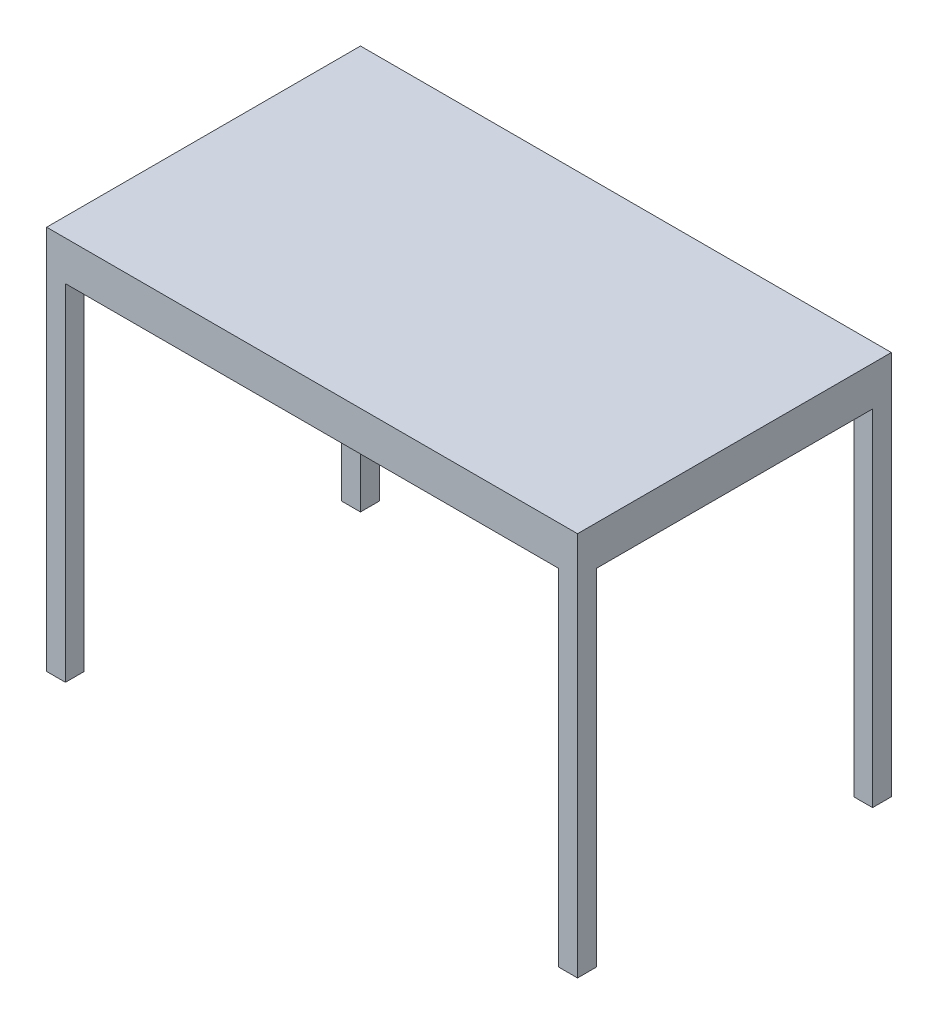
ISO-10303-21;
HEADER;
FILE_DESCRIPTION(('STEP AP214'),'2;1');
FILE_NAME('part.step','',(''),(''),'','','');
FILE_SCHEMA(('AUTOMOTIVE_DESIGN { 1 0 10303 214 1 1 1 1 }'));
ENDSEC;
DATA;
#1=APPLICATION_CONTEXT('core data for automotive mechanical design processes');
#2=APPLICATION_PROTOCOL_DEFINITION('international standard','automotive_design',2000,#1);
#3=PRODUCT_CONTEXT('',#1,'mechanical');
#4=PRODUCT('Part','Part','',(#3));
#5=PRODUCT_RELATED_PRODUCT_CATEGORY('part','',(#4));
#6=PRODUCT_DEFINITION_FORMATION('','',#4);
#7=PRODUCT_DEFINITION_CONTEXT('part definition',#1,'design');
#8=PRODUCT_DEFINITION('design','',#6,#7);
#9=PRODUCT_DEFINITION_SHAPE('','',#8);
#10=(LENGTH_UNIT() NAMED_UNIT(*) SI_UNIT(.MILLI.,.METRE.));
#11=(NAMED_UNIT(*) PLANE_ANGLE_UNIT() SI_UNIT($,.RADIAN.));
#12=(NAMED_UNIT(*) SI_UNIT($,.STERADIAN.) SOLID_ANGLE_UNIT());
#13=UNCERTAINTY_MEASURE_WITH_UNIT(LENGTH_MEASURE(1.E-05),#10,'distance_accuracy_value','');
#14=(GEOMETRIC_REPRESENTATION_CONTEXT(3) GLOBAL_UNCERTAINTY_ASSIGNED_CONTEXT((#13)) GLOBAL_UNIT_ASSIGNED_CONTEXT((#10,
#11,#12)) REPRESENTATION_CONTEXT('',''));
#15=CARTESIAN_POINT('',(0.,0.,0.));
#16=DIRECTION('',(0.,0.,1.));
#17=DIRECTION('',(1.,0.,0.));
#18=AXIS2_PLACEMENT_3D('',#15,#16,#17);
#19=CARTESIAN_POINT('',(0.,700.,0.));
#20=DIRECTION('',(0.,1.,0.));
#21=DIRECTION('',(0.,0.,1.));
#22=AXIS2_PLACEMENT_3D('',#19,#20,#21);
#23=PLANE('',#22);
#24=DIRECTION('',(-1.,0.,0.));
#25=VECTOR('',#24,1.);
#26=CARTESIAN_POINT('',(1038.1,700.,598.1));
#27=LINE('',#26,#25);
#28=CARTESIAN_POINT('',(1076.2,700.,598.1));
#29=VERTEX_POINT('',#28);
#30=CARTESIAN_POINT('',(1038.1,700.,598.1));
#31=VERTEX_POINT('',#30);
#32=EDGE_CURVE('E48',#29,#31,#27,.T.);
#33=ORIENTED_EDGE('',*,*,#32,.T.);
#34=DIRECTION('',(0.,0.,1.));
#35=VECTOR('',#34,1.);
#36=CARTESIAN_POINT('',(1038.1,700.,636.2));
#37=LINE('',#36,#35);
#38=CARTESIAN_POINT('',(1038.1,700.,636.2));
#39=VERTEX_POINT('',#38);
#40=EDGE_CURVE('E158',#31,#39,#37,.T.);
#41=ORIENTED_EDGE('',*,*,#40,.T.);
#42=DIRECTION('',(1.,0.,0.));
#43=VECTOR('',#42,1.);
#44=CARTESIAN_POINT('',(0.,700.,636.2));
#45=LINE('',#44,#43);
#46=CARTESIAN_POINT('',(38.1,700.,636.2));
#47=VERTEX_POINT('',#46);
#48=EDGE_CURVE('E239',#47,#39,#45,.T.);
#49=ORIENTED_EDGE('',*,*,#48,.F.);
#50=DIRECTION('',(0.,0.,-1.));
#51=VECTOR('',#50,1.);
#52=CARTESIAN_POINT('',(38.1,700.,636.2));
#53=LINE('',#52,#51);
#54=CARTESIAN_POINT('',(38.1,700.,598.1));
#55=VERTEX_POINT('',#54);
#56=EDGE_CURVE('E180',#47,#55,#53,.T.);
#57=ORIENTED_EDGE('',*,*,#56,.T.);
#58=DIRECTION('',(-1.,0.,0.));
#59=VECTOR('',#58,1.);
#60=CARTESIAN_POINT('',(0.,700.,598.1));
#61=LINE('',#60,#59);
#62=CARTESIAN_POINT('',(0.,700.,598.1));
#63=VERTEX_POINT('',#62);
#64=EDGE_CURVE('E183',#55,#63,#61,.T.);
#65=ORIENTED_EDGE('',*,*,#64,.T.);
#66=DIRECTION('',(0.,0.,1.));
#67=VECTOR('',#66,1.);
#68=CARTESIAN_POINT('',(0.,700.,0.));
#69=LINE('',#68,#67);
#70=CARTESIAN_POINT('',(0.,700.,38.1));
#71=VERTEX_POINT('',#70);
#72=EDGE_CURVE('E224',#71,#63,#69,.T.);
#73=ORIENTED_EDGE('',*,*,#72,.F.);
#74=DIRECTION('',(1.,0.,0.));
#75=VECTOR('',#74,1.);
#76=CARTESIAN_POINT('',(0.,700.,38.1));
#77=LINE('',#76,#75);
#78=CARTESIAN_POINT('',(38.1,700.,38.1));
#79=VERTEX_POINT('',#78);
#80=EDGE_CURVE('E249',#71,#79,#77,.T.);
#81=ORIENTED_EDGE('',*,*,#80,.T.);
#82=DIRECTION('',(0.,0.,-1.));
#83=VECTOR('',#82,1.);
#84=CARTESIAN_POINT('',(38.1,700.,0.));
#85=LINE('',#84,#83);
#86=CARTESIAN_POINT('',(38.1,700.,0.));
#87=VERTEX_POINT('',#86);
#88=EDGE_CURVE('E252',#79,#87,#85,.T.);
#89=ORIENTED_EDGE('',*,*,#88,.T.);
#90=DIRECTION('',(-1.,0.,0.));
#91=VECTOR('',#90,1.);
#92=CARTESIAN_POINT('',(0.,700.,0.));
#93=LINE('',#92,#91);
#94=CARTESIAN_POINT('',(1038.1,700.,0.));
#95=VERTEX_POINT('',#94);
#96=EDGE_CURVE('E229',#95,#87,#93,.T.);
#97=ORIENTED_EDGE('',*,*,#96,.F.);
#98=DIRECTION('',(0.,0.,1.));
#99=VECTOR('',#98,1.);
#100=CARTESIAN_POINT('',(1038.1,700.,0.));
#101=LINE('',#100,#99);
#102=CARTESIAN_POINT('',(1038.1,700.,38.1));
#103=VERTEX_POINT('',#102);
#104=EDGE_CURVE('E202',#95,#103,#101,.T.);
#105=ORIENTED_EDGE('',*,*,#104,.T.);
#106=DIRECTION('',(1.,0.,0.));
#107=VECTOR('',#106,1.);
#108=CARTESIAN_POINT('',(1038.1,700.,38.1));
#109=LINE('',#108,#107);
#110=CARTESIAN_POINT('',(1076.2,700.,38.1));
#111=VERTEX_POINT('',#110);
#112=EDGE_CURVE('E205',#103,#111,#109,.T.);
#113=ORIENTED_EDGE('',*,*,#112,.T.);
#114=DIRECTION('',(0.,0.,-1.));
#115=VECTOR('',#114,1.);
#116=CARTESIAN_POINT('',(1076.2,700.,0.));
#117=LINE('',#116,#115);
#118=EDGE_CURVE('E166',#29,#111,#117,.T.);
#119=ORIENTED_EDGE('',*,*,#118,.F.);
#120=EDGE_LOOP('',(#33,#41,#49,#57,#65,#73,#81,#89,#97,#105,#113,#119));
#121=FACE_BOUND('',#120,.T.);
#122=ADVANCED_FACE('F33',(#121),#23,.F.);
#123=CARTESIAN_POINT('',(0.,700.,0.));
#124=DIRECTION('',(1.,0.,0.));
#125=DIRECTION('',(0.,0.,-1.));
#126=AXIS2_PLACEMENT_3D('',#123,#124,#125);
#127=PLANE('',#126);
#128=DIRECTION('',(0.,0.,1.));
#129=VECTOR('',#128,1.);
#130=CARTESIAN_POINT('',(0.,0.,0.));
#131=LINE('',#130,#129);
#132=CARTESIAN_POINT('',(0.,0.,0.));
#133=VERTEX_POINT('',#132);
#134=CARTESIAN_POINT('',(0.,0.,38.1));
#135=VERTEX_POINT('',#134);
#136=EDGE_CURVE('E248',#133,#135,#131,.T.);
#137=ORIENTED_EDGE('',*,*,#136,.T.);
#138=DIRECTION('',(0.,-1.,0.));
#139=VECTOR('',#138,1.);
#140=CARTESIAN_POINT('',(0.,700.,38.1));
#141=LINE('',#140,#139);
#142=EDGE_CURVE('E11',#71,#135,#141,.T.);
#143=ORIENTED_EDGE('',*,*,#142,.F.);
#144=ORIENTED_EDGE('',*,*,#72,.T.);
#145=DIRECTION('',(0.,-1.,0.));
#146=VECTOR('',#145,1.);
#147=CARTESIAN_POINT('',(0.,700.,598.1));
#148=LINE('',#147,#146);
#149=CARTESIAN_POINT('',(0.,0.,598.1));
#150=VERTEX_POINT('',#149);
#151=EDGE_CURVE('E187',#63,#150,#148,.T.);
#152=ORIENTED_EDGE('',*,*,#151,.T.);
#153=DIRECTION('',(0.,0.,1.));
#154=VECTOR('',#153,1.);
#155=CARTESIAN_POINT('',(0.,0.,636.2));
#156=LINE('',#155,#154);
#157=CARTESIAN_POINT('',(0.,0.,636.2));
#158=VERTEX_POINT('',#157);
#159=EDGE_CURVE('E184',#150,#158,#156,.T.);
#160=ORIENTED_EDGE('',*,*,#159,.T.);
#161=DIRECTION('',(0.,-1.,0.));
#162=VECTOR('',#161,1.);
#163=CARTESIAN_POINT('',(0.,780.,636.2));
#164=LINE('',#163,#162);
#165=CARTESIAN_POINT('',(0.,780.,636.2));
#166=VERTEX_POINT('',#165);
#167=EDGE_CURVE('E246',#166,#158,#164,.T.);
#168=ORIENTED_EDGE('',*,*,#167,.F.);
#169=DIRECTION('',(0.,0.,1.));
#170=VECTOR('',#169,1.);
#171=CARTESIAN_POINT('',(0.,780.,0.));
#172=LINE('',#171,#170);
#173=CARTESIAN_POINT('',(0.,780.,0.));
#174=VERTEX_POINT('',#173);
#175=EDGE_CURVE('E225',#174,#166,#172,.T.);
#176=ORIENTED_EDGE('',*,*,#175,.F.);
#177=DIRECTION('',(0.,-1.,0.));
#178=VECTOR('',#177,1.);
#179=CARTESIAN_POINT('',(0.,700.,0.));
#180=LINE('',#179,#178);
#181=EDGE_CURVE('E256',#174,#133,#180,.T.);
#182=ORIENTED_EDGE('',*,*,#181,.T.);
#183=EDGE_LOOP('',(#137,#143,#144,#152,#160,#168,#176,#182));
#184=FACE_BOUND('',#183,.T.);
#185=ADVANCED_FACE('F35',(#184),#127,.F.);
#186=CARTESIAN_POINT('',(0.,700.,38.1));
#187=DIRECTION('',(0.,0.,-1.));
#188=DIRECTION('',(-1.,0.,0.));
#189=AXIS2_PLACEMENT_3D('',#186,#187,#188);
#190=PLANE('',#189);
#191=DIRECTION('',(1.,0.,0.));
#192=VECTOR('',#191,1.);
#193=CARTESIAN_POINT('',(0.,0.,38.1));
#194=LINE('',#193,#192);
#195=CARTESIAN_POINT('',(38.1,0.,38.1));
#196=VERTEX_POINT('',#195);
#197=EDGE_CURVE('E259',#135,#196,#194,.T.);
#198=ORIENTED_EDGE('',*,*,#197,.T.);
#199=DIRECTION('',(0.,-1.,0.));
#200=VECTOR('',#199,1.);
#201=CARTESIAN_POINT('',(38.1,700.,38.1));
#202=LINE('',#201,#200);
#203=EDGE_CURVE('E41',#79,#196,#202,.T.);
#204=ORIENTED_EDGE('',*,*,#203,.F.);
#205=ORIENTED_EDGE('',*,*,#80,.F.);
#206=ORIENTED_EDGE('',*,*,#142,.T.);
#207=EDGE_LOOP('',(#198,#204,#205,#206));
#208=FACE_BOUND('',#207,.T.);
#209=ADVANCED_FACE('F308',(#208),#190,.F.);
#210=CARTESIAN_POINT('',(38.1,700.,0.));
#211=DIRECTION('',(-1.,0.,0.));
#212=DIRECTION('',(0.,0.,1.));
#213=AXIS2_PLACEMENT_3D('',#210,#211,#212);
#214=PLANE('',#213);
#215=DIRECTION('',(0.,0.,-1.));
#216=VECTOR('',#215,1.);
#217=CARTESIAN_POINT('',(38.1,0.,0.));
#218=LINE('',#217,#216);
#219=CARTESIAN_POINT('',(38.1,0.,0.));
#220=VERTEX_POINT('',#219);
#221=EDGE_CURVE('E261',#196,#220,#218,.T.);
#222=ORIENTED_EDGE('',*,*,#221,.T.);
#223=DIRECTION('',(0.,-1.,0.));
#224=VECTOR('',#223,1.);
#225=CARTESIAN_POINT('',(38.1,700.,0.));
#226=LINE('',#225,#224);
#227=EDGE_CURVE('E266',#87,#220,#226,.T.);
#228=ORIENTED_EDGE('',*,*,#227,.F.);
#229=ORIENTED_EDGE('',*,*,#88,.F.);
#230=ORIENTED_EDGE('',*,*,#203,.T.);
#231=EDGE_LOOP('',(#222,#228,#229,#230));
#232=FACE_BOUND('',#231,.T.);
#233=ADVANCED_FACE('F272',(#232),#214,.F.);
#234=CARTESIAN_POINT('',(0.,700.,0.));
#235=DIRECTION('',(0.,0.,1.));
#236=DIRECTION('',(1.,0.,0.));
#237=AXIS2_PLACEMENT_3D('',#234,#235,#236);
#238=PLANE('',#237);
#239=DIRECTION('',(-1.,0.,0.));
#240=VECTOR('',#239,1.);
#241=CARTESIAN_POINT('',(0.,0.,0.));
#242=LINE('',#241,#240);
#243=EDGE_CURVE('E253',#220,#133,#242,.T.);
#244=ORIENTED_EDGE('',*,*,#243,.T.);
#245=ORIENTED_EDGE('',*,*,#181,.F.);
#246=DIRECTION('',(-1.,0.,0.));
#247=VECTOR('',#246,1.);
#248=CARTESIAN_POINT('',(0.,780.,0.));
#249=LINE('',#248,#247);
#250=CARTESIAN_POINT('',(1076.2,780.,0.));
#251=VERTEX_POINT('',#250);
#252=EDGE_CURVE('E233',#251,#174,#249,.T.);
#253=ORIENTED_EDGE('',*,*,#252,.F.);
#254=DIRECTION('',(0.,-1.,0.));
#255=VECTOR('',#254,1.);
#256=CARTESIAN_POINT('',(1076.2,780.,0.));
#257=LINE('',#256,#255);
#258=CARTESIAN_POINT('',(1076.2,0.,0.));
#259=VERTEX_POINT('',#258);
#260=EDGE_CURVE('E236',#251,#259,#257,.T.);
#261=ORIENTED_EDGE('',*,*,#260,.T.);
#262=DIRECTION('',(-1.,0.,0.));
#263=VECTOR('',#262,1.);
#264=CARTESIAN_POINT('',(1038.1,0.,0.));
#265=LINE('',#264,#263);
#266=CARTESIAN_POINT('',(1038.1,0.,0.));
#267=VERTEX_POINT('',#266);
#268=EDGE_CURVE('E211',#259,#267,#265,.T.);
#269=ORIENTED_EDGE('',*,*,#268,.T.);
#270=DIRECTION('',(0.,-1.,0.));
#271=VECTOR('',#270,1.);
#272=CARTESIAN_POINT('',(1038.1,700.,0.));
#273=LINE('',#272,#271);
#274=EDGE_CURVE('E221',#95,#267,#273,.T.);
#275=ORIENTED_EDGE('',*,*,#274,.F.);
#276=ORIENTED_EDGE('',*,*,#96,.T.);
#277=ORIENTED_EDGE('',*,*,#227,.T.);
#278=EDGE_LOOP('',(#244,#245,#253,#261,#269,#275,#276,#277));
#279=FACE_BOUND('',#278,.T.);
#280=ADVANCED_FACE('F280',(#279),#238,.F.);
#281=CARTESIAN_POINT('',(0.,0.,0.));
#282=DIRECTION('',(0.,1.,0.));
#283=DIRECTION('',(0.,0.,1.));
#284=AXIS2_PLACEMENT_3D('',#281,#282,#283);
#285=PLANE('',#284);
#286=ORIENTED_EDGE('',*,*,#136,.F.);
#287=ORIENTED_EDGE('',*,*,#243,.F.);
#288=ORIENTED_EDGE('',*,*,#221,.F.);
#289=ORIENTED_EDGE('',*,*,#197,.F.);
#290=EDGE_LOOP('',(#286,#287,#288,#289));
#291=FACE_BOUND('',#290,.T.);
#292=ADVANCED_FACE('F278',(#291),#285,.F.);
#293=CARTESIAN_POINT('',(0.,780.,636.2));
#294=DIRECTION('',(0.,0.,-1.));
#295=DIRECTION('',(-1.,0.,0.));
#296=AXIS2_PLACEMENT_3D('',#293,#294,#295);
#297=PLANE('',#296);
#298=ORIENTED_EDGE('',*,*,#167,.T.);
#299=DIRECTION('',(1.,0.,0.));
#300=VECTOR('',#299,1.);
#301=CARTESIAN_POINT('',(0.,0.,636.2));
#302=LINE('',#301,#300);
#303=CARTESIAN_POINT('',(38.1,0.,636.2));
#304=VERTEX_POINT('',#303);
#305=EDGE_CURVE('E179',#158,#304,#302,.T.);
#306=ORIENTED_EDGE('',*,*,#305,.T.);
#307=DIRECTION('',(0.,-1.,0.));
#308=VECTOR('',#307,1.);
#309=CARTESIAN_POINT('',(38.1,700.,636.2));
#310=LINE('',#309,#308);
#311=EDGE_CURVE('E56',#47,#304,#310,.T.);
#312=ORIENTED_EDGE('',*,*,#311,.F.);
#313=ORIENTED_EDGE('',*,*,#48,.T.);
#314=DIRECTION('',(0.,-1.,0.));
#315=VECTOR('',#314,1.);
#316=CARTESIAN_POINT('',(1038.1,700.,636.2));
#317=LINE('',#316,#315);
#318=CARTESIAN_POINT('',(1038.1,0.,636.2));
#319=VERTEX_POINT('',#318);
#320=EDGE_CURVE('E155',#39,#319,#317,.T.);
#321=ORIENTED_EDGE('',*,*,#320,.T.);
#322=DIRECTION('',(1.,0.,0.));
#323=VECTOR('',#322,1.);
#324=CARTESIAN_POINT('',(1038.1,0.,636.2));
#325=LINE('',#324,#323);
#326=CARTESIAN_POINT('',(1076.2,0.,636.2));
#327=VERTEX_POINT('',#326);
#328=EDGE_CURVE('E171',#319,#327,#325,.T.);
#329=ORIENTED_EDGE('',*,*,#328,.T.);
#330=DIRECTION('',(0.,-1.,0.));
#331=VECTOR('',#330,1.);
#332=CARTESIAN_POINT('',(1076.2,780.,636.2));
#333=LINE('',#332,#331);
#334=CARTESIAN_POINT('',(1076.2,780.,636.2));
#335=VERTEX_POINT('',#334);
#336=EDGE_CURVE('E244',#335,#327,#333,.T.);
#337=ORIENTED_EDGE('',*,*,#336,.F.);
#338=DIRECTION('',(1.,0.,0.));
#339=VECTOR('',#338,1.);
#340=CARTESIAN_POINT('',(0.,780.,636.2));
#341=LINE('',#340,#339);
#342=EDGE_CURVE('E228',#166,#335,#341,.T.);
#343=ORIENTED_EDGE('',*,*,#342,.F.);
#344=EDGE_LOOP('',(#298,#306,#312,#313,#321,#329,#337,#343));
#345=FACE_BOUND('',#344,.T.);
#346=ADVANCED_FACE('F316',(#345),#297,.F.);
#347=CARTESIAN_POINT('',(1076.2,780.,0.));
#348=DIRECTION('',(-1.,0.,0.));
#349=DIRECTION('',(0.,0.,1.));
#350=AXIS2_PLACEMENT_3D('',#347,#348,#349);
#351=PLANE('',#350);
#352=ORIENTED_EDGE('',*,*,#336,.T.);
#353=DIRECTION('',(0.,0.,-1.));
#354=VECTOR('',#353,1.);
#355=CARTESIAN_POINT('',(1076.2,0.,636.2));
#356=LINE('',#355,#354);
#357=CARTESIAN_POINT('',(1076.2,0.,598.1));
#358=VERTEX_POINT('',#357);
#359=EDGE_CURVE('E174',#327,#358,#356,.T.);
#360=ORIENTED_EDGE('',*,*,#359,.T.);
#361=DIRECTION('',(0.,-1.,0.));
#362=VECTOR('',#361,1.);
#363=CARTESIAN_POINT('',(1076.2,700.,598.1));
#364=LINE('',#363,#362);
#365=EDGE_CURVE('E154',#29,#358,#364,.T.);
#366=ORIENTED_EDGE('',*,*,#365,.F.);
#367=ORIENTED_EDGE('',*,*,#118,.T.);
#368=DIRECTION('',(0.,-1.,0.));
#369=VECTOR('',#368,1.);
#370=CARTESIAN_POINT('',(1076.2,700.,38.1));
#371=LINE('',#370,#369);
#372=CARTESIAN_POINT('',(1076.2,0.,38.1));
#373=VERTEX_POINT('',#372);
#374=EDGE_CURVE('E208',#111,#373,#371,.T.);
#375=ORIENTED_EDGE('',*,*,#374,.T.);
#376=DIRECTION('',(0.,0.,-1.));
#377=VECTOR('',#376,1.);
#378=CARTESIAN_POINT('',(1076.2,0.,0.));
#379=LINE('',#378,#377);
#380=EDGE_CURVE('E201',#373,#259,#379,.T.);
#381=ORIENTED_EDGE('',*,*,#380,.T.);
#382=ORIENTED_EDGE('',*,*,#260,.F.);
#383=DIRECTION('',(0.,0.,-1.));
#384=VECTOR('',#383,1.);
#385=CARTESIAN_POINT('',(1076.2,780.,0.));
#386=LINE('',#385,#384);
#387=EDGE_CURVE('E231',#335,#251,#386,.T.);
#388=ORIENTED_EDGE('',*,*,#387,.F.);
#389=EDGE_LOOP('',(#352,#360,#366,#367,#375,#381,#382,#388));
#390=FACE_BOUND('',#389,.T.);
#391=ADVANCED_FACE('F298',(#390),#351,.F.);
#392=CARTESIAN_POINT('',(0.,780.,0.));
#393=DIRECTION('',(0.,1.,0.));
#394=DIRECTION('',(0.,0.,1.));
#395=AXIS2_PLACEMENT_3D('',#392,#393,#394);
#396=PLANE('',#395);
#397=ORIENTED_EDGE('',*,*,#175,.T.);
#398=ORIENTED_EDGE('',*,*,#342,.T.);
#399=ORIENTED_EDGE('',*,*,#387,.T.);
#400=ORIENTED_EDGE('',*,*,#252,.T.);
#401=EDGE_LOOP('',(#397,#398,#399,#400));
#402=FACE_BOUND('',#401,.T.);
#403=ADVANCED_FACE('F287',(#402),#396,.T.);
#404=CARTESIAN_POINT('',(1038.1,700.,0.));
#405=DIRECTION('',(1.,0.,0.));
#406=DIRECTION('',(0.,0.,-1.));
#407=AXIS2_PLACEMENT_3D('',#404,#405,#406);
#408=PLANE('',#407);
#409=DIRECTION('',(0.,0.,1.));
#410=VECTOR('',#409,1.);
#411=CARTESIAN_POINT('',(1038.1,0.,0.));
#412=LINE('',#411,#410);
#413=CARTESIAN_POINT('',(1038.1,0.,38.1));
#414=VERTEX_POINT('',#413);
#415=EDGE_CURVE('E213',#267,#414,#412,.T.);
#416=ORIENTED_EDGE('',*,*,#415,.T.);
#417=DIRECTION('',(0.,-1.,0.));
#418=VECTOR('',#417,1.);
#419=CARTESIAN_POINT('',(1038.1,700.,38.1));
#420=LINE('',#419,#418);
#421=EDGE_CURVE('E218',#103,#414,#420,.T.);
#422=ORIENTED_EDGE('',*,*,#421,.F.);
#423=ORIENTED_EDGE('',*,*,#104,.F.);
#424=ORIENTED_EDGE('',*,*,#274,.T.);
#425=EDGE_LOOP('',(#416,#422,#423,#424));
#426=FACE_BOUND('',#425,.T.);
#427=ADVANCED_FACE('F306',(#426),#408,.F.);
#428=CARTESIAN_POINT('',(1038.1,700.,38.1));
#429=DIRECTION('',(0.,0.,-1.));
#430=DIRECTION('',(-1.,0.,0.));
#431=AXIS2_PLACEMENT_3D('',#428,#429,#430);
#432=PLANE('',#431);
#433=DIRECTION('',(1.,0.,0.));
#434=VECTOR('',#433,1.);
#435=CARTESIAN_POINT('',(1038.1,0.,38.1));
#436=LINE('',#435,#434);
#437=EDGE_CURVE('E206',#414,#373,#436,.T.);
#438=ORIENTED_EDGE('',*,*,#437,.T.);
#439=ORIENTED_EDGE('',*,*,#374,.F.);
#440=ORIENTED_EDGE('',*,*,#112,.F.);
#441=ORIENTED_EDGE('',*,*,#421,.T.);
#442=EDGE_LOOP('',(#438,#439,#440,#441));
#443=FACE_BOUND('',#442,.T.);
#444=ADVANCED_FACE('F302',(#443),#432,.F.);
#445=CARTESIAN_POINT('',(0.,0.,0.));
#446=DIRECTION('',(0.,1.,0.));
#447=DIRECTION('',(0.,0.,1.));
#448=AXIS2_PLACEMENT_3D('',#445,#446,#447);
#449=PLANE('',#448);
#450=ORIENTED_EDGE('',*,*,#380,.F.);
#451=ORIENTED_EDGE('',*,*,#437,.F.);
#452=ORIENTED_EDGE('',*,*,#415,.F.);
#453=ORIENTED_EDGE('',*,*,#268,.F.);
#454=EDGE_LOOP('',(#450,#451,#452,#453));
#455=FACE_BOUND('',#454,.T.);
#456=ADVANCED_FACE('F296',(#455),#449,.F.);
#457=CARTESIAN_POINT('',(38.1,700.,636.2));
#458=DIRECTION('',(-1.,0.,0.));
#459=DIRECTION('',(0.,0.,1.));
#460=AXIS2_PLACEMENT_3D('',#457,#458,#459);
#461=PLANE('',#460);
#462=DIRECTION('',(0.,0.,-1.));
#463=VECTOR('',#462,1.);
#464=CARTESIAN_POINT('',(38.1,0.,636.2));
#465=LINE('',#464,#463);
#466=CARTESIAN_POINT('',(38.1,0.,598.1));
#467=VERTEX_POINT('',#466);
#468=EDGE_CURVE('E189',#304,#467,#465,.T.);
#469=ORIENTED_EDGE('',*,*,#468,.T.);
#470=DIRECTION('',(0.,-1.,0.));
#471=VECTOR('',#470,1.);
#472=CARTESIAN_POINT('',(38.1,700.,598.1));
#473=LINE('',#472,#471);
#474=EDGE_CURVE('E197',#55,#467,#473,.T.);
#475=ORIENTED_EDGE('',*,*,#474,.F.);
#476=ORIENTED_EDGE('',*,*,#56,.F.);
#477=ORIENTED_EDGE('',*,*,#311,.T.);
#478=EDGE_LOOP('',(#469,#475,#476,#477));
#479=FACE_BOUND('',#478,.T.);
#480=ADVANCED_FACE('F322',(#479),#461,.F.);
#481=CARTESIAN_POINT('',(0.,700.,598.1));
#482=DIRECTION('',(0.,0.,1.));
#483=DIRECTION('',(1.,0.,0.));
#484=AXIS2_PLACEMENT_3D('',#481,#482,#483);
#485=PLANE('',#484);
#486=DIRECTION('',(-1.,0.,0.));
#487=VECTOR('',#486,1.);
#488=CARTESIAN_POINT('',(0.,0.,598.1));
#489=LINE('',#488,#487);
#490=EDGE_CURVE('E191',#467,#150,#489,.T.);
#491=ORIENTED_EDGE('',*,*,#490,.T.);
#492=ORIENTED_EDGE('',*,*,#151,.F.);
#493=ORIENTED_EDGE('',*,*,#64,.F.);
#494=ORIENTED_EDGE('',*,*,#474,.T.);
#495=EDGE_LOOP('',(#491,#492,#493,#494));
#496=FACE_BOUND('',#495,.T.);
#497=ADVANCED_FACE('F323',(#496),#485,.F.);
#498=CARTESIAN_POINT('',(0.,0.,0.));
#499=DIRECTION('',(0.,1.,0.));
#500=DIRECTION('',(0.,0.,1.));
#501=AXIS2_PLACEMENT_3D('',#498,#499,#500);
#502=PLANE('',#501);
#503=ORIENTED_EDGE('',*,*,#305,.F.);
#504=ORIENTED_EDGE('',*,*,#159,.F.);
#505=ORIENTED_EDGE('',*,*,#490,.F.);
#506=ORIENTED_EDGE('',*,*,#468,.F.);
#507=EDGE_LOOP('',(#503,#504,#505,#506));
#508=FACE_BOUND('',#507,.T.);
#509=ADVANCED_FACE('F315',(#508),#502,.F.);
#510=CARTESIAN_POINT('',(1038.1,700.,598.1));
#511=DIRECTION('',(0.,0.,1.));
#512=DIRECTION('',(1.,0.,0.));
#513=AXIS2_PLACEMENT_3D('',#510,#511,#512);
#514=PLANE('',#513);
#515=DIRECTION('',(-1.,0.,0.));
#516=VECTOR('',#515,1.);
#517=CARTESIAN_POINT('',(1038.1,0.,598.1));
#518=LINE('',#517,#516);
#519=CARTESIAN_POINT('',(1038.1,0.,598.1));
#520=VERTEX_POINT('',#519);
#521=EDGE_CURVE('E151',#358,#520,#518,.T.);
#522=ORIENTED_EDGE('',*,*,#521,.T.);
#523=DIRECTION('',(0.,-1.,0.));
#524=VECTOR('',#523,1.);
#525=CARTESIAN_POINT('',(1038.1,700.,598.1));
#526=LINE('',#525,#524);
#527=EDGE_CURVE('E147',#31,#520,#526,.T.);
#528=ORIENTED_EDGE('',*,*,#527,.F.);
#529=ORIENTED_EDGE('',*,*,#32,.F.);
#530=ORIENTED_EDGE('',*,*,#365,.T.);
#531=EDGE_LOOP('',(#522,#528,#529,#530));
#532=FACE_BOUND('',#531,.T.);
#533=ADVANCED_FACE('F149',(#532),#514,.F.);
#534=CARTESIAN_POINT('',(1038.1,700.,636.2));
#535=DIRECTION('',(1.,0.,0.));
#536=DIRECTION('',(0.,0.,-1.));
#537=AXIS2_PLACEMENT_3D('',#534,#535,#536);
#538=PLANE('',#537);
#539=DIRECTION('',(0.,0.,1.));
#540=VECTOR('',#539,1.);
#541=CARTESIAN_POINT('',(1038.1,0.,636.2));
#542=LINE('',#541,#540);
#543=EDGE_CURVE('E167',#520,#319,#542,.T.);
#544=ORIENTED_EDGE('',*,*,#543,.T.);
#545=ORIENTED_EDGE('',*,*,#320,.F.);
#546=ORIENTED_EDGE('',*,*,#40,.F.);
#547=ORIENTED_EDGE('',*,*,#527,.T.);
#548=EDGE_LOOP('',(#544,#545,#546,#547));
#549=FACE_BOUND('',#548,.T.);
#550=ADVANCED_FACE('F159',(#549),#538,.F.);
#551=CARTESIAN_POINT('',(0.,0.,0.));
#552=DIRECTION('',(0.,1.,0.));
#553=DIRECTION('',(0.,0.,1.));
#554=AXIS2_PLACEMENT_3D('',#551,#552,#553);
#555=PLANE('',#554);
#556=ORIENTED_EDGE('',*,*,#328,.F.);
#557=ORIENTED_EDGE('',*,*,#543,.F.);
#558=ORIENTED_EDGE('',*,*,#521,.F.);
#559=ORIENTED_EDGE('',*,*,#359,.F.);
#560=EDGE_LOOP('',(#556,#557,#558,#559));
#561=FACE_BOUND('',#560,.T.);
#562=ADVANCED_FACE('F320',(#561),#555,.F.);
#563=CLOSED_SHELL('',(#122,#185,#209,#233,#280,#292,#346,#391,#403,#427,#444,#456,#480,#497,
#509,#533,#550,#562));
#564=MANIFOLD_SOLID_BREP('B2',#563);
#565=ADVANCED_BREP_SHAPE_REPRESENTATION('',(#18,#564),#14);
#566=SHAPE_DEFINITION_REPRESENTATION(#9,#565);
ENDSEC;
END-ISO-10303-21;
